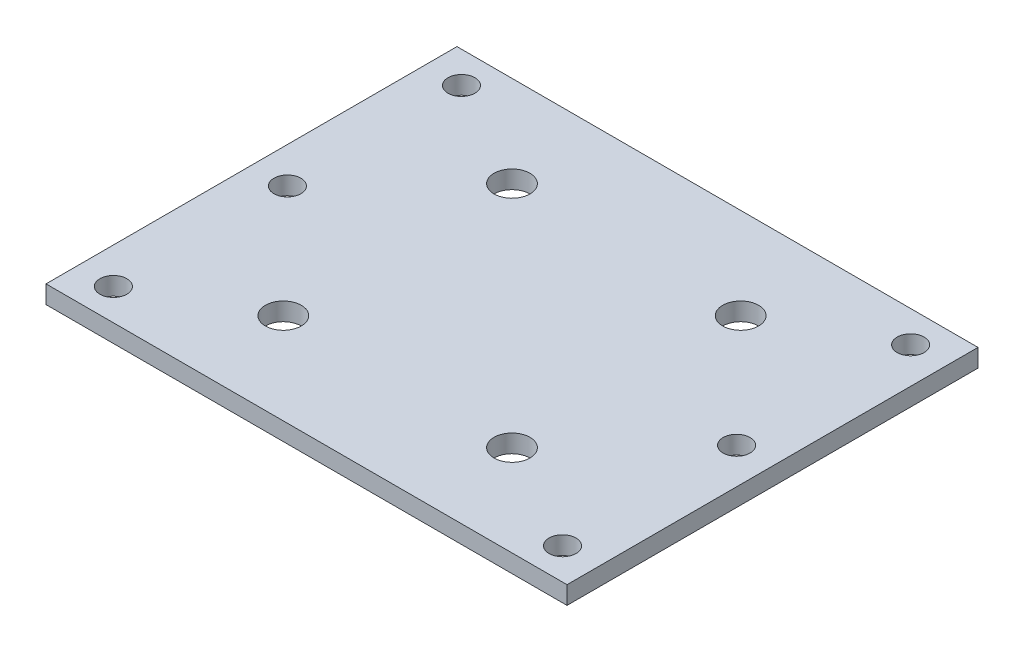
ISO-10303-21;
HEADER;
FILE_DESCRIPTION(('STEP AP214'),'2;1');
FILE_NAME('part.step','',(''),(''),'','','');
FILE_SCHEMA(('AUTOMOTIVE_DESIGN { 1 0 10303 214 1 1 1 1 }'));
ENDSEC;
DATA;
#1=APPLICATION_CONTEXT('core data for automotive mechanical design processes');
#2=APPLICATION_PROTOCOL_DEFINITION('international standard','automotive_design',2000,#1);
#3=PRODUCT_CONTEXT('',#1,'mechanical');
#4=PRODUCT('Part','Part','',(#3));
#5=PRODUCT_RELATED_PRODUCT_CATEGORY('part','',(#4));
#6=PRODUCT_DEFINITION_FORMATION('','',#4);
#7=PRODUCT_DEFINITION_CONTEXT('part definition',#1,'design');
#8=PRODUCT_DEFINITION('design','',#6,#7);
#9=PRODUCT_DEFINITION_SHAPE('','',#8);
#10=(LENGTH_UNIT() NAMED_UNIT(*) SI_UNIT(.MILLI.,.METRE.));
#11=(NAMED_UNIT(*) PLANE_ANGLE_UNIT() SI_UNIT($,.RADIAN.));
#12=(NAMED_UNIT(*) SI_UNIT($,.STERADIAN.) SOLID_ANGLE_UNIT());
#13=UNCERTAINTY_MEASURE_WITH_UNIT(LENGTH_MEASURE(1.E-05),#10,'distance_accuracy_value','');
#14=(GEOMETRIC_REPRESENTATION_CONTEXT(3) GLOBAL_UNCERTAINTY_ASSIGNED_CONTEXT((#13)) GLOBAL_UNIT_ASSIGNED_CONTEXT((#10,
#11,#12)) REPRESENTATION_CONTEXT('',''));
#15=CARTESIAN_POINT('',(0.,0.,0.));
#16=DIRECTION('',(0.,0.,1.));
#17=DIRECTION('',(1.,0.,0.));
#18=AXIS2_PLACEMENT_3D('',#15,#16,#17);
#19=CARTESIAN_POINT('',(29.,2.,22.875));
#20=DIRECTION('',(-1.,0.,0.));
#21=DIRECTION('',(0.,0.,1.));
#22=AXIS2_PLACEMENT_3D('',#19,#20,#21);
#23=PLANE('',#22);
#24=DIRECTION('',(0.,0.,-1.));
#25=VECTOR('',#24,1.);
#26=CARTESIAN_POINT('',(29.,0.,22.875));
#27=LINE('',#26,#25);
#28=CARTESIAN_POINT('',(29.,0.,22.875));
#29=VERTEX_POINT('',#28);
#30=CARTESIAN_POINT('',(29.,0.,-22.875));
#31=VERTEX_POINT('',#30);
#32=EDGE_CURVE('E113',#29,#31,#27,.T.);
#33=ORIENTED_EDGE('',*,*,#32,.T.);
#34=DIRECTION('',(0.,-1.,0.));
#35=VECTOR('',#34,1.);
#36=CARTESIAN_POINT('',(29.,2.,-22.875));
#37=LINE('',#36,#35);
#38=CARTESIAN_POINT('',(29.,2.,-22.875));
#39=VERTEX_POINT('',#38);
#40=EDGE_CURVE('E12',#39,#31,#37,.T.);
#41=ORIENTED_EDGE('',*,*,#40,.F.);
#42=DIRECTION('',(0.,0.,-1.));
#43=VECTOR('',#42,1.);
#44=CARTESIAN_POINT('',(29.,2.,22.875));
#45=LINE('',#44,#43);
#46=CARTESIAN_POINT('',(29.,2.,22.875));
#47=VERTEX_POINT('',#46);
#48=EDGE_CURVE('E97',#47,#39,#45,.T.);
#49=ORIENTED_EDGE('',*,*,#48,.F.);
#50=DIRECTION('',(0.,-1.,0.));
#51=VECTOR('',#50,1.);
#52=CARTESIAN_POINT('',(29.,2.,22.875));
#53=LINE('',#52,#51);
#54=EDGE_CURVE('E109',#47,#29,#53,.T.);
#55=ORIENTED_EDGE('',*,*,#54,.T.);
#56=EDGE_LOOP('',(#33,#41,#49,#55));
#57=FACE_BOUND('',#56,.T.);
#58=ADVANCED_FACE('F44',(#57),#23,.F.);
#59=CARTESIAN_POINT('',(-29.,2.,-22.875));
#60=DIRECTION('',(0.,0.,1.));
#61=DIRECTION('',(1.,0.,0.));
#62=AXIS2_PLACEMENT_3D('',#59,#60,#61);
#63=PLANE('',#62);
#64=DIRECTION('',(-1.,0.,0.));
#65=VECTOR('',#64,1.);
#66=CARTESIAN_POINT('',(-29.,0.,-22.875));
#67=LINE('',#66,#65);
#68=CARTESIAN_POINT('',(-29.,0.,-22.875));
#69=VERTEX_POINT('',#68);
#70=EDGE_CURVE('E102',#31,#69,#67,.T.);
#71=ORIENTED_EDGE('',*,*,#70,.T.);
#72=DIRECTION('',(0.,-1.,0.));
#73=VECTOR('',#72,1.);
#74=CARTESIAN_POINT('',(-29.,2.,-22.875));
#75=LINE('',#74,#73);
#76=CARTESIAN_POINT('',(-29.,2.,-22.875));
#77=VERTEX_POINT('',#76);
#78=EDGE_CURVE('E54',#77,#69,#75,.T.);
#79=ORIENTED_EDGE('',*,*,#78,.F.);
#80=DIRECTION('',(-1.,0.,0.));
#81=VECTOR('',#80,1.);
#82=CARTESIAN_POINT('',(-29.,2.,-22.875));
#83=LINE('',#82,#81);
#84=EDGE_CURVE('E92',#39,#77,#83,.T.);
#85=ORIENTED_EDGE('',*,*,#84,.F.);
#86=ORIENTED_EDGE('',*,*,#40,.T.);
#87=EDGE_LOOP('',(#71,#79,#85,#86));
#88=FACE_BOUND('',#87,.T.);
#89=ADVANCED_FACE('F101',(#88),#63,.F.);
#90=CARTESIAN_POINT('',(-29.,2.,22.875));
#91=DIRECTION('',(1.,0.,0.));
#92=DIRECTION('',(0.,0.,-1.));
#93=AXIS2_PLACEMENT_3D('',#90,#91,#92);
#94=PLANE('',#93);
#95=DIRECTION('',(0.,0.,1.));
#96=VECTOR('',#95,1.);
#97=CARTESIAN_POINT('',(-29.,0.,22.875));
#98=LINE('',#97,#96);
#99=CARTESIAN_POINT('',(-29.,0.,22.875));
#100=VERTEX_POINT('',#99);
#101=EDGE_CURVE('E79',#69,#100,#98,.T.);
#102=ORIENTED_EDGE('',*,*,#101,.T.);
#103=DIRECTION('',(0.,-1.,0.));
#104=VECTOR('',#103,1.);
#105=CARTESIAN_POINT('',(-29.,2.,22.875));
#106=LINE('',#105,#104);
#107=CARTESIAN_POINT('',(-29.,2.,22.875));
#108=VERTEX_POINT('',#107);
#109=EDGE_CURVE('E104',#108,#100,#106,.T.);
#110=ORIENTED_EDGE('',*,*,#109,.F.);
#111=DIRECTION('',(0.,0.,1.));
#112=VECTOR('',#111,1.);
#113=CARTESIAN_POINT('',(-29.,2.,22.875));
#114=LINE('',#113,#112);
#115=EDGE_CURVE('E95',#77,#108,#114,.T.);
#116=ORIENTED_EDGE('',*,*,#115,.F.);
#117=ORIENTED_EDGE('',*,*,#78,.T.);
#118=EDGE_LOOP('',(#102,#110,#116,#117));
#119=FACE_BOUND('',#118,.T.);
#120=ADVANCED_FACE('F105',(#119),#94,.F.);
#121=CARTESIAN_POINT('',(-29.,2.,22.875));
#122=DIRECTION('',(0.,0.,-1.));
#123=DIRECTION('',(-1.,0.,0.));
#124=AXIS2_PLACEMENT_3D('',#121,#122,#123);
#125=PLANE('',#124);
#126=DIRECTION('',(1.,0.,0.));
#127=VECTOR('',#126,1.);
#128=CARTESIAN_POINT('',(-29.,0.,22.875));
#129=LINE('',#128,#127);
#130=EDGE_CURVE('E85',#100,#29,#129,.T.);
#131=ORIENTED_EDGE('',*,*,#130,.T.);
#132=ORIENTED_EDGE('',*,*,#54,.F.);
#133=DIRECTION('',(1.,0.,0.));
#134=VECTOR('',#133,1.);
#135=CARTESIAN_POINT('',(-29.,2.,22.875));
#136=LINE('',#135,#134);
#137=EDGE_CURVE('E62',#108,#47,#136,.T.);
#138=ORIENTED_EDGE('',*,*,#137,.F.);
#139=ORIENTED_EDGE('',*,*,#109,.T.);
#140=EDGE_LOOP('',(#131,#132,#138,#139));
#141=FACE_BOUND('',#140,.T.);
#142=ADVANCED_FACE('F127',(#141),#125,.F.);
#143=CARTESIAN_POINT('',(0.,2.,0.));
#144=DIRECTION('',(0.,-1.,0.));
#145=DIRECTION('',(0.,0.,-1.));
#146=AXIS2_PLACEMENT_3D('',#143,#144,#145);
#147=PLANE('',#146);
#148=CARTESIAN_POINT('',(-25.,2.,-19.375));
#149=DIRECTION('',(0.,-1.,0.));
#150=DIRECTION('',(0.,0.,-1.));
#151=AXIS2_PLACEMENT_3D('',#148,#149,#150);
#152=CIRCLE('',#151,1.49999999999999);
#153=CARTESIAN_POINT('',(-25.,2.,-20.875));
#154=VERTEX_POINT('',#153);
#155=EDGE_CURVE('E205',#154,#154,#152,.T.);
#156=ORIENTED_EDGE('',*,*,#155,.T.);
#157=EDGE_LOOP('',(#156));
#158=FACE_BOUND('',#157,.T.);
#159=CARTESIAN_POINT('',(25.,2.,19.375));
#160=DIRECTION('',(0.,-1.,0.));
#161=DIRECTION('',(0.,0.,-1.));
#162=AXIS2_PLACEMENT_3D('',#159,#160,#161);
#163=CIRCLE('',#162,1.49999999999999);
#164=CARTESIAN_POINT('',(25.,2.,17.875));
#165=VERTEX_POINT('',#164);
#166=EDGE_CURVE('E197',#165,#165,#163,.T.);
#167=ORIENTED_EDGE('',*,*,#166,.T.);
#168=EDGE_LOOP('',(#167));
#169=FACE_BOUND('',#168,.T.);
#170=CARTESIAN_POINT('',(25.,2.,-19.375));
#171=DIRECTION('',(0.,-1.,0.));
#172=DIRECTION('',(0.,0.,-1.));
#173=AXIS2_PLACEMENT_3D('',#170,#171,#172);
#174=CIRCLE('',#173,1.49999999999999);
#175=CARTESIAN_POINT('',(25.,2.,-20.875));
#176=VERTEX_POINT('',#175);
#177=EDGE_CURVE('E189',#176,#176,#174,.T.);
#178=ORIENTED_EDGE('',*,*,#177,.T.);
#179=EDGE_LOOP('',(#178));
#180=FACE_BOUND('',#179,.T.);
#181=CARTESIAN_POINT('',(-25.,2.,19.375));
#182=DIRECTION('',(0.,-1.,0.));
#183=DIRECTION('',(0.,0.,-1.));
#184=AXIS2_PLACEMENT_3D('',#181,#182,#183);
#185=CIRCLE('',#184,1.49999999999999);
#186=CARTESIAN_POINT('',(-25.,2.,17.875));
#187=VERTEX_POINT('',#186);
#188=EDGE_CURVE('E181',#187,#187,#185,.T.);
#189=ORIENTED_EDGE('',*,*,#188,.T.);
#190=EDGE_LOOP('',(#189));
#191=FACE_BOUND('',#190,.T.);
#192=CARTESIAN_POINT('',(25.,2.,0.));
#193=DIRECTION('',(0.,-1.,0.));
#194=DIRECTION('',(0.,0.,-1.));
#195=AXIS2_PLACEMENT_3D('',#192,#193,#194);
#196=CIRCLE('',#195,1.49999999999999);
#197=CARTESIAN_POINT('',(25.,2.,-1.49999999999998));
#198=VERTEX_POINT('',#197);
#199=EDGE_CURVE('E173',#198,#198,#196,.T.);
#200=ORIENTED_EDGE('',*,*,#199,.T.);
#201=EDGE_LOOP('',(#200));
#202=FACE_BOUND('',#201,.T.);
#203=CARTESIAN_POINT('',(-25.,2.,0.));
#204=DIRECTION('',(0.,-1.,0.));
#205=DIRECTION('',(0.,0.,-1.));
#206=AXIS2_PLACEMENT_3D('',#203,#204,#205);
#207=CIRCLE('',#206,1.49999999999999);
#208=CARTESIAN_POINT('',(-25.,2.,-1.49999999999999));
#209=VERTEX_POINT('',#208);
#210=EDGE_CURVE('E165',#209,#209,#207,.T.);
#211=ORIENTED_EDGE('',*,*,#210,.T.);
#212=EDGE_LOOP('',(#211));
#213=FACE_BOUND('',#212,.T.);
#214=CARTESIAN_POINT('',(-12.7279220613578,2.,-12.7279220613579));
#215=DIRECTION('',(0.,1.,0.));
#216=DIRECTION('',(0.,0.,1.));
#217=AXIS2_PLACEMENT_3D('',#214,#215,#216);
#218=CIRCLE('',#217,2.);
#219=CARTESIAN_POINT('',(-12.7279220613578,2.,-10.7279220613579));
#220=VERTEX_POINT('',#219);
#221=EDGE_CURVE('E161',#220,#220,#218,.T.);
#222=ORIENTED_EDGE('',*,*,#221,.F.);
#223=EDGE_LOOP('',(#222));
#224=FACE_BOUND('',#223,.T.);
#225=CARTESIAN_POINT('',(12.7279220613579,2.,-12.7279220613585));
#226=DIRECTION('',(0.,1.,0.));
#227=DIRECTION('',(0.,0.,1.));
#228=AXIS2_PLACEMENT_3D('',#225,#226,#227);
#229=CIRCLE('',#228,2.);
#230=CARTESIAN_POINT('',(12.7279220613579,2.,-10.7279220613585));
#231=VERTEX_POINT('',#230);
#232=EDGE_CURVE('E153',#231,#231,#229,.T.);
#233=ORIENTED_EDGE('',*,*,#232,.F.);
#234=EDGE_LOOP('',(#233));
#235=FACE_BOUND('',#234,.T.);
#236=CARTESIAN_POINT('',(12.7279220613585,2.,12.7279220613572));
#237=DIRECTION('',(0.,1.,0.));
#238=DIRECTION('',(0.,0.,1.));
#239=AXIS2_PLACEMENT_3D('',#236,#237,#238);
#240=CIRCLE('',#239,2.);
#241=CARTESIAN_POINT('',(12.7279220613585,2.,14.7279220613572));
#242=VERTEX_POINT('',#241);
#243=EDGE_CURVE('E145',#242,#242,#240,.T.);
#244=ORIENTED_EDGE('',*,*,#243,.F.);
#245=EDGE_LOOP('',(#244));
#246=FACE_BOUND('',#245,.T.);
#247=CARTESIAN_POINT('',(-12.7279220613572,2.,12.7279220613578));
#248=DIRECTION('',(0.,1.,0.));
#249=DIRECTION('',(0.,0.,1.));
#250=AXIS2_PLACEMENT_3D('',#247,#248,#249);
#251=CIRCLE('',#250,2.);
#252=CARTESIAN_POINT('',(-12.7279220613572,2.,14.7279220613578));
#253=VERTEX_POINT('',#252);
#254=EDGE_CURVE('E137',#253,#253,#251,.T.);
#255=ORIENTED_EDGE('',*,*,#254,.F.);
#256=EDGE_LOOP('',(#255));
#257=FACE_BOUND('',#256,.T.);
#258=ORIENTED_EDGE('',*,*,#48,.T.);
#259=ORIENTED_EDGE('',*,*,#84,.T.);
#260=ORIENTED_EDGE('',*,*,#115,.T.);
#261=ORIENTED_EDGE('',*,*,#137,.T.);
#262=EDGE_LOOP('',(#258,#259,#260,#261));
#263=FACE_BOUND('',#262,.T.);
#264=ADVANCED_FACE('F93',(#158,#169,#180,#191,#202,#213,#224,#235,#246,#257,#263),#147,.F.);
#265=CARTESIAN_POINT('',(0.,0.,0.));
#266=DIRECTION('',(0.,-1.,0.));
#267=DIRECTION('',(0.,0.,-1.));
#268=AXIS2_PLACEMENT_3D('',#265,#266,#267);
#269=PLANE('',#268);
#270=CARTESIAN_POINT('',(-25.,0.,-19.375));
#271=DIRECTION('',(0.,-1.,0.));
#272=DIRECTION('',(0.,0.,-1.));
#273=AXIS2_PLACEMENT_3D('',#270,#271,#272);
#274=CIRCLE('',#273,1.49999999999999);
#275=CARTESIAN_POINT('',(-25.,0.,-20.875));
#276=VERTEX_POINT('',#275);
#277=EDGE_CURVE('E209',#276,#276,#274,.T.);
#278=ORIENTED_EDGE('',*,*,#277,.F.);
#279=EDGE_LOOP('',(#278));
#280=FACE_BOUND('',#279,.T.);
#281=CARTESIAN_POINT('',(25.,0.,19.375));
#282=DIRECTION('',(0.,-1.,0.));
#283=DIRECTION('',(0.,0.,-1.));
#284=AXIS2_PLACEMENT_3D('',#281,#282,#283);
#285=CIRCLE('',#284,1.49999999999999);
#286=CARTESIAN_POINT('',(25.,0.,17.875));
#287=VERTEX_POINT('',#286);
#288=EDGE_CURVE('E201',#287,#287,#285,.T.);
#289=ORIENTED_EDGE('',*,*,#288,.F.);
#290=EDGE_LOOP('',(#289));
#291=FACE_BOUND('',#290,.T.);
#292=CARTESIAN_POINT('',(25.,0.,-19.375));
#293=DIRECTION('',(0.,-1.,0.));
#294=DIRECTION('',(0.,0.,-1.));
#295=AXIS2_PLACEMENT_3D('',#292,#293,#294);
#296=CIRCLE('',#295,1.49999999999999);
#297=CARTESIAN_POINT('',(25.,0.,-20.875));
#298=VERTEX_POINT('',#297);
#299=EDGE_CURVE('E193',#298,#298,#296,.T.);
#300=ORIENTED_EDGE('',*,*,#299,.F.);
#301=EDGE_LOOP('',(#300));
#302=FACE_BOUND('',#301,.T.);
#303=CARTESIAN_POINT('',(-25.,0.,19.375));
#304=DIRECTION('',(0.,-1.,0.));
#305=DIRECTION('',(0.,0.,-1.));
#306=AXIS2_PLACEMENT_3D('',#303,#304,#305);
#307=CIRCLE('',#306,1.49999999999999);
#308=CARTESIAN_POINT('',(-25.,0.,17.875));
#309=VERTEX_POINT('',#308);
#310=EDGE_CURVE('E185',#309,#309,#307,.T.);
#311=ORIENTED_EDGE('',*,*,#310,.F.);
#312=EDGE_LOOP('',(#311));
#313=FACE_BOUND('',#312,.T.);
#314=CARTESIAN_POINT('',(25.,0.,0.));
#315=DIRECTION('',(0.,-1.,0.));
#316=DIRECTION('',(0.,0.,-1.));
#317=AXIS2_PLACEMENT_3D('',#314,#315,#316);
#318=CIRCLE('',#317,1.49999999999999);
#319=CARTESIAN_POINT('',(25.,0.,-1.49999999999998));
#320=VERTEX_POINT('',#319);
#321=EDGE_CURVE('E177',#320,#320,#318,.T.);
#322=ORIENTED_EDGE('',*,*,#321,.F.);
#323=EDGE_LOOP('',(#322));
#324=FACE_BOUND('',#323,.T.);
#325=CARTESIAN_POINT('',(-25.,0.,0.));
#326=DIRECTION('',(0.,-1.,0.));
#327=DIRECTION('',(0.,0.,-1.));
#328=AXIS2_PLACEMENT_3D('',#325,#326,#327);
#329=CIRCLE('',#328,1.49999999999999);
#330=CARTESIAN_POINT('',(-25.,0.,-1.49999999999999));
#331=VERTEX_POINT('',#330);
#332=EDGE_CURVE('E169',#331,#331,#329,.T.);
#333=ORIENTED_EDGE('',*,*,#332,.F.);
#334=EDGE_LOOP('',(#333));
#335=FACE_BOUND('',#334,.T.);
#336=CARTESIAN_POINT('',(-12.7279220613578,0.,-12.7279220613579));
#337=DIRECTION('',(0.,1.,0.));
#338=DIRECTION('',(0.,0.,1.));
#339=AXIS2_PLACEMENT_3D('',#336,#337,#338);
#340=CIRCLE('',#339,2.);
#341=CARTESIAN_POINT('',(-12.7279220613578,0.,-10.7279220613579));
#342=VERTEX_POINT('',#341);
#343=EDGE_CURVE('E157',#342,#342,#340,.T.);
#344=ORIENTED_EDGE('',*,*,#343,.T.);
#345=EDGE_LOOP('',(#344));
#346=FACE_BOUND('',#345,.T.);
#347=CARTESIAN_POINT('',(12.7279220613579,0.,-12.7279220613585));
#348=DIRECTION('',(0.,1.,0.));
#349=DIRECTION('',(0.,0.,1.));
#350=AXIS2_PLACEMENT_3D('',#347,#348,#349);
#351=CIRCLE('',#350,2.);
#352=CARTESIAN_POINT('',(12.7279220613579,0.,-10.7279220613585));
#353=VERTEX_POINT('',#352);
#354=EDGE_CURVE('E149',#353,#353,#351,.T.);
#355=ORIENTED_EDGE('',*,*,#354,.T.);
#356=EDGE_LOOP('',(#355));
#357=FACE_BOUND('',#356,.T.);
#358=CARTESIAN_POINT('',(12.7279220613585,0.,12.7279220613572));
#359=DIRECTION('',(0.,1.,0.));
#360=DIRECTION('',(0.,0.,1.));
#361=AXIS2_PLACEMENT_3D('',#358,#359,#360);
#362=CIRCLE('',#361,2.);
#363=CARTESIAN_POINT('',(12.7279220613585,0.,14.7279220613572));
#364=VERTEX_POINT('',#363);
#365=EDGE_CURVE('E141',#364,#364,#362,.T.);
#366=ORIENTED_EDGE('',*,*,#365,.T.);
#367=EDGE_LOOP('',(#366));
#368=FACE_BOUND('',#367,.T.);
#369=CARTESIAN_POINT('',(-12.7279220613572,0.,12.7279220613578));
#370=DIRECTION('',(0.,1.,0.));
#371=DIRECTION('',(0.,0.,1.));
#372=AXIS2_PLACEMENT_3D('',#369,#370,#371);
#373=CIRCLE('',#372,2.);
#374=CARTESIAN_POINT('',(-12.7279220613572,0.,14.7279220613578));
#375=VERTEX_POINT('',#374);
#376=EDGE_CURVE('E117',#375,#375,#373,.T.);
#377=ORIENTED_EDGE('',*,*,#376,.T.);
#378=EDGE_LOOP('',(#377));
#379=FACE_BOUND('',#378,.T.);
#380=ORIENTED_EDGE('',*,*,#32,.F.);
#381=ORIENTED_EDGE('',*,*,#130,.F.);
#382=ORIENTED_EDGE('',*,*,#101,.F.);
#383=ORIENTED_EDGE('',*,*,#70,.F.);
#384=EDGE_LOOP('',(#380,#381,#382,#383));
#385=FACE_BOUND('',#384,.T.);
#386=ADVANCED_FACE('F130',(#280,#291,#302,#313,#324,#335,#346,#357,#368,#379,#385),#269,.T.);
#387=CARTESIAN_POINT('',(-12.7279220613572,2.,12.7279220613578));
#388=DIRECTION('',(0.,1.,0.));
#389=DIRECTION('',(0.,0.,1.));
#390=AXIS2_PLACEMENT_3D('',#387,#388,#389);
#391=CYLINDRICAL_SURFACE('',#390,2.);
#392=ORIENTED_EDGE('',*,*,#376,.F.);
#393=EDGE_LOOP('',(#392));
#394=FACE_BOUND('',#393,.T.);
#395=ORIENTED_EDGE('',*,*,#254,.T.);
#396=EDGE_LOOP('',(#395));
#397=FACE_BOUND('',#396,.T.);
#398=ADVANCED_FACE('F219',(#394,#397),#391,.F.);
#399=CARTESIAN_POINT('',(12.7279220613585,2.,12.7279220613572));
#400=DIRECTION('',(0.,1.,0.));
#401=DIRECTION('',(0.,0.,1.));
#402=AXIS2_PLACEMENT_3D('',#399,#400,#401);
#403=CYLINDRICAL_SURFACE('',#402,2.);
#404=ORIENTED_EDGE('',*,*,#365,.F.);
#405=EDGE_LOOP('',(#404));
#406=FACE_BOUND('',#405,.T.);
#407=ORIENTED_EDGE('',*,*,#243,.T.);
#408=EDGE_LOOP('',(#407));
#409=FACE_BOUND('',#408,.T.);
#410=ADVANCED_FACE('F241',(#406,#409),#403,.F.);
#411=CARTESIAN_POINT('',(12.7279220613579,2.,-12.7279220613585));
#412=DIRECTION('',(0.,1.,0.));
#413=DIRECTION('',(0.,0.,1.));
#414=AXIS2_PLACEMENT_3D('',#411,#412,#413);
#415=CYLINDRICAL_SURFACE('',#414,2.);
#416=ORIENTED_EDGE('',*,*,#354,.F.);
#417=EDGE_LOOP('',(#416));
#418=FACE_BOUND('',#417,.T.);
#419=ORIENTED_EDGE('',*,*,#232,.T.);
#420=EDGE_LOOP('',(#419));
#421=FACE_BOUND('',#420,.T.);
#422=ADVANCED_FACE('F284',(#418,#421),#415,.F.);
#423=CARTESIAN_POINT('',(-12.7279220613578,2.,-12.7279220613579));
#424=DIRECTION('',(0.,1.,0.));
#425=DIRECTION('',(0.,0.,1.));
#426=AXIS2_PLACEMENT_3D('',#423,#424,#425);
#427=CYLINDRICAL_SURFACE('',#426,2.);
#428=ORIENTED_EDGE('',*,*,#343,.F.);
#429=EDGE_LOOP('',(#428));
#430=FACE_BOUND('',#429,.T.);
#431=ORIENTED_EDGE('',*,*,#221,.T.);
#432=EDGE_LOOP('',(#431));
#433=FACE_BOUND('',#432,.T.);
#434=ADVANCED_FACE('F294',(#430,#433),#427,.F.);
#435=CARTESIAN_POINT('',(-25.,0.,0.));
#436=DIRECTION('',(0.,-1.,0.));
#437=DIRECTION('',(0.,0.,-1.));
#438=AXIS2_PLACEMENT_3D('',#435,#436,#437);
#439=CYLINDRICAL_SURFACE('',#438,1.49999999999999);
#440=ORIENTED_EDGE('',*,*,#332,.T.);
#441=EDGE_LOOP('',(#440));
#442=FACE_BOUND('',#441,.T.);
#443=ORIENTED_EDGE('',*,*,#210,.F.);
#444=EDGE_LOOP('',(#443));
#445=FACE_BOUND('',#444,.T.);
#446=ADVANCED_FACE('F303',(#442,#445),#439,.F.);
#447=CARTESIAN_POINT('',(25.,0.,0.));
#448=DIRECTION('',(0.,-1.,0.));
#449=DIRECTION('',(0.,0.,-1.));
#450=AXIS2_PLACEMENT_3D('',#447,#448,#449);
#451=CYLINDRICAL_SURFACE('',#450,1.49999999999999);
#452=ORIENTED_EDGE('',*,*,#321,.T.);
#453=EDGE_LOOP('',(#452));
#454=FACE_BOUND('',#453,.T.);
#455=ORIENTED_EDGE('',*,*,#199,.F.);
#456=EDGE_LOOP('',(#455));
#457=FACE_BOUND('',#456,.T.);
#458=ADVANCED_FACE('F322',(#454,#457),#451,.F.);
#459=CARTESIAN_POINT('',(-25.,0.,19.375));
#460=DIRECTION('',(0.,-1.,0.));
#461=DIRECTION('',(0.,0.,-1.));
#462=AXIS2_PLACEMENT_3D('',#459,#460,#461);
#463=CYLINDRICAL_SURFACE('',#462,1.49999999999999);
#464=ORIENTED_EDGE('',*,*,#310,.T.);
#465=EDGE_LOOP('',(#464));
#466=FACE_BOUND('',#465,.T.);
#467=ORIENTED_EDGE('',*,*,#188,.F.);
#468=EDGE_LOOP('',(#467));
#469=FACE_BOUND('',#468,.T.);
#470=ADVANCED_FACE('F332',(#466,#469),#463,.F.);
#471=CARTESIAN_POINT('',(25.,0.,-19.375));
#472=DIRECTION('',(0.,-1.,0.));
#473=DIRECTION('',(0.,0.,-1.));
#474=AXIS2_PLACEMENT_3D('',#471,#472,#473);
#475=CYLINDRICAL_SURFACE('',#474,1.49999999999999);
#476=ORIENTED_EDGE('',*,*,#299,.T.);
#477=EDGE_LOOP('',(#476));
#478=FACE_BOUND('',#477,.T.);
#479=ORIENTED_EDGE('',*,*,#177,.F.);
#480=EDGE_LOOP('',(#479));
#481=FACE_BOUND('',#480,.T.);
#482=ADVANCED_FACE('F342',(#478,#481),#475,.F.);
#483=CARTESIAN_POINT('',(25.,0.,19.375));
#484=DIRECTION('',(0.,-1.,0.));
#485=DIRECTION('',(0.,0.,-1.));
#486=AXIS2_PLACEMENT_3D('',#483,#484,#485);
#487=CYLINDRICAL_SURFACE('',#486,1.49999999999999);
#488=ORIENTED_EDGE('',*,*,#288,.T.);
#489=EDGE_LOOP('',(#488));
#490=FACE_BOUND('',#489,.T.);
#491=ORIENTED_EDGE('',*,*,#166,.F.);
#492=EDGE_LOOP('',(#491));
#493=FACE_BOUND('',#492,.T.);
#494=ADVANCED_FACE('F352',(#490,#493),#487,.F.);
#495=CARTESIAN_POINT('',(-25.,0.,-19.375));
#496=DIRECTION('',(0.,-1.,0.));
#497=DIRECTION('',(0.,0.,-1.));
#498=AXIS2_PLACEMENT_3D('',#495,#496,#497);
#499=CYLINDRICAL_SURFACE('',#498,1.49999999999999);
#500=ORIENTED_EDGE('',*,*,#277,.T.);
#501=EDGE_LOOP('',(#500));
#502=FACE_BOUND('',#501,.T.);
#503=ORIENTED_EDGE('',*,*,#155,.F.);
#504=EDGE_LOOP('',(#503));
#505=FACE_BOUND('',#504,.T.);
#506=ADVANCED_FACE('F214',(#502,#505),#499,.F.);
#507=CLOSED_SHELL('',(#58,#89,#120,#142,#264,#386,#398,#410,#422,#434,#446,#458,#470,#482,#494,#506));
#508=MANIFOLD_SOLID_BREP('B2',#507);
#509=ADVANCED_BREP_SHAPE_REPRESENTATION('',(#18,#508),#14);
#510=SHAPE_DEFINITION_REPRESENTATION(#9,#509);
ENDSEC;
END-ISO-10303-21;
